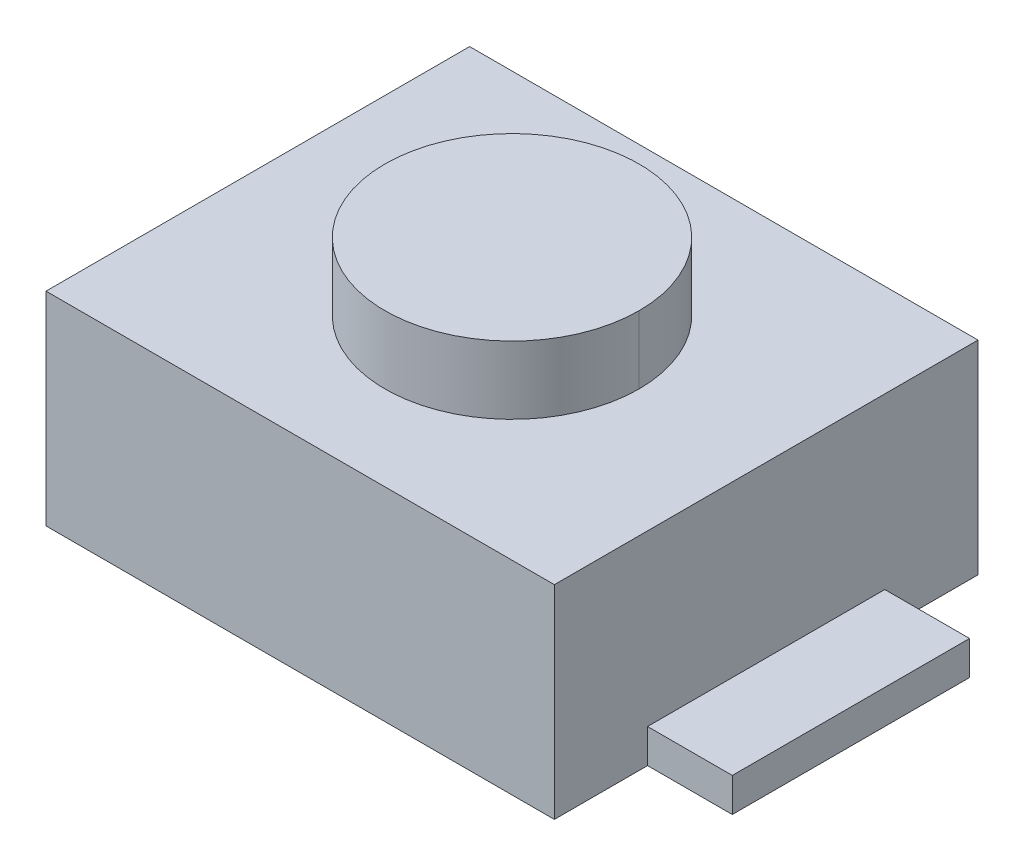
ISO-10303-21;
HEADER;
FILE_DESCRIPTION(('STEP AP214'),'2;1');
FILE_NAME('part.step','',(''),(''),'','','');
FILE_SCHEMA(('AUTOMOTIVE_DESIGN { 1 0 10303 214 1 1 1 1 }'));
ENDSEC;
DATA;
#1=APPLICATION_CONTEXT('core data for automotive mechanical design processes');
#2=APPLICATION_PROTOCOL_DEFINITION('international standard','automotive_design',2000,#1);
#3=PRODUCT_CONTEXT('',#1,'mechanical');
#4=PRODUCT('Part','Part','',(#3));
#5=PRODUCT_RELATED_PRODUCT_CATEGORY('part','',(#4));
#6=PRODUCT_DEFINITION_FORMATION('','',#4);
#7=PRODUCT_DEFINITION_CONTEXT('part definition',#1,'design');
#8=PRODUCT_DEFINITION('design','',#6,#7);
#9=PRODUCT_DEFINITION_SHAPE('','',#8);
#10=(LENGTH_UNIT() NAMED_UNIT(*) SI_UNIT(.MILLI.,.METRE.));
#11=(NAMED_UNIT(*) PLANE_ANGLE_UNIT() SI_UNIT($,.RADIAN.));
#12=(NAMED_UNIT(*) SI_UNIT($,.STERADIAN.) SOLID_ANGLE_UNIT());
#13=UNCERTAINTY_MEASURE_WITH_UNIT(LENGTH_MEASURE(1.E-05),#10,'distance_accuracy_value','');
#14=(GEOMETRIC_REPRESENTATION_CONTEXT(3) GLOBAL_UNCERTAINTY_ASSIGNED_CONTEXT((#13)) GLOBAL_UNIT_ASSIGNED_CONTEXT((#10,
#11,#12)) REPRESENTATION_CONTEXT('',''));
#15=CARTESIAN_POINT('',(0.,0.,0.));
#16=DIRECTION('',(0.,0.,1.));
#17=DIRECTION('',(1.,0.,0.));
#18=AXIS2_PLACEMENT_3D('',#15,#16,#17);
#19=CARTESIAN_POINT('',(0.,1.3,0.));
#20=DIRECTION('',(0.,-1.,0.));
#21=DIRECTION('',(0.,0.,1.));
#22=AXIS2_PLACEMENT_3D('',#19,#20,#21);
#23=CYLINDRICAL_SURFACE('',#22,0.75);
#24=DIRECTION('',(0.,1.,0.));
#25=VECTOR('',#24,1.);
#26=CARTESIAN_POINT('',(0.75,1.3,0.));
#27=LINE('',#26,#25);
#28=CARTESIAN_POINT('',(0.75,1.2,0.));
#29=VERTEX_POINT('',#28);
#30=CARTESIAN_POINT('',(0.75,1.6,0.));
#31=VERTEX_POINT('',#30);
#32=EDGE_CURVE('E11',#29,#31,#27,.T.);
#33=ORIENTED_EDGE('',*,*,#32,.F.);
#34=CARTESIAN_POINT('',(0.,1.2,0.));
#35=DIRECTION('',(0.,-1.,0.));
#36=DIRECTION('',(1.,0.,0.));
#37=AXIS2_PLACEMENT_3D('',#34,#35,#36);
#38=CIRCLE('',#37,0.75);
#39=CARTESIAN_POINT('',(-0.75,1.2,0.));
#40=VERTEX_POINT('',#39);
#41=EDGE_CURVE('E25',#40,#29,#38,.T.);
#42=ORIENTED_EDGE('',*,*,#41,.F.);
#43=DIRECTION('',(0.,-1.,0.));
#44=VECTOR('',#43,1.);
#45=CARTESIAN_POINT('',(-0.75,1.3,0.));
#46=LINE('',#45,#44);
#47=CARTESIAN_POINT('',(-0.75,1.6,0.));
#48=VERTEX_POINT('',#47);
#49=EDGE_CURVE('E303',#48,#40,#46,.T.);
#50=ORIENTED_EDGE('',*,*,#49,.F.);
#51=CARTESIAN_POINT('',(0.,1.6,0.));
#52=DIRECTION('',(0.,1.,0.));
#53=DIRECTION('',(1.,0.,0.));
#54=AXIS2_PLACEMENT_3D('',#51,#52,#53);
#55=CIRCLE('',#54,0.75);
#56=EDGE_CURVE('E298',#31,#48,#55,.T.);
#57=ORIENTED_EDGE('',*,*,#56,.F.);
#58=EDGE_LOOP('',(#33,#42,#50,#57));
#59=FACE_BOUND('',#58,.T.);
#60=ADVANCED_FACE('F17',(#59),#23,.T.);
#61=CARTESIAN_POINT('',(0.,1.6,0.));
#62=DIRECTION('',(0.,1.,0.));
#63=DIRECTION('',(1.,0.,0.));
#64=AXIS2_PLACEMENT_3D('',#61,#62,#63);
#65=PLANE('',#64);
#66=ORIENTED_EDGE('',*,*,#56,.T.);
#67=CARTESIAN_POINT('',(0.,1.6,0.));
#68=DIRECTION('',(0.,1.,0.));
#69=DIRECTION('',(1.,0.,0.));
#70=AXIS2_PLACEMENT_3D('',#67,#68,#69);
#71=CIRCLE('',#70,0.75);
#72=EDGE_CURVE('E293',#48,#31,#71,.T.);
#73=ORIENTED_EDGE('',*,*,#72,.T.);
#74=EDGE_LOOP('',(#66,#73));
#75=FACE_BOUND('',#74,.T.);
#76=ADVANCED_FACE('F317',(#75),#65,.T.);
#77=CARTESIAN_POINT('',(0.,1.3,0.));
#78=DIRECTION('',(0.,-1.,0.));
#79=DIRECTION('',(0.,0.,-1.));
#80=AXIS2_PLACEMENT_3D('',#77,#78,#79);
#81=CYLINDRICAL_SURFACE('',#80,0.75);
#82=ORIENTED_EDGE('',*,*,#32,.T.);
#83=ORIENTED_EDGE('',*,*,#72,.F.);
#84=ORIENTED_EDGE('',*,*,#49,.T.);
#85=CARTESIAN_POINT('',(0.,1.2,0.));
#86=DIRECTION('',(0.,-1.,0.));
#87=DIRECTION('',(1.,0.,0.));
#88=AXIS2_PLACEMENT_3D('',#85,#86,#87);
#89=CIRCLE('',#88,0.75);
#90=EDGE_CURVE('E288',#29,#40,#89,.T.);
#91=ORIENTED_EDGE('',*,*,#90,.F.);
#92=EDGE_LOOP('',(#82,#83,#84,#91));
#93=FACE_BOUND('',#92,.T.);
#94=ADVANCED_FACE('F314',(#93),#81,.T.);
#95=CARTESIAN_POINT('',(0.,1.2,0.));
#96=DIRECTION('',(0.,-1.,0.));
#97=DIRECTION('',(0.,0.,-1.));
#98=AXIS2_PLACEMENT_3D('',#95,#96,#97);
#99=PLANE('',#98);
#100=DIRECTION('',(0.,0.,-1.));
#101=VECTOR('',#100,1.);
#102=CARTESIAN_POINT('',(1.5,1.2,0.));
#103=LINE('',#102,#101);
#104=CARTESIAN_POINT('',(1.5,1.2,1.25));
#105=VERTEX_POINT('',#104);
#106=CARTESIAN_POINT('',(1.5,1.2,-1.25));
#107=VERTEX_POINT('',#106);
#108=EDGE_CURVE('E284',#105,#107,#103,.T.);
#109=ORIENTED_EDGE('',*,*,#108,.T.);
#110=DIRECTION('',(1.,0.,0.));
#111=VECTOR('',#110,1.);
#112=CARTESIAN_POINT('',(0.,1.2,-1.25));
#113=LINE('',#112,#111);
#114=CARTESIAN_POINT('',(-1.5,1.2,-1.25));
#115=VERTEX_POINT('',#114);
#116=EDGE_CURVE('E279',#115,#107,#113,.T.);
#117=ORIENTED_EDGE('',*,*,#116,.F.);
#118=DIRECTION('',(0.,0.,-1.));
#119=VECTOR('',#118,1.);
#120=CARTESIAN_POINT('',(-1.5,1.2,0.));
#121=LINE('',#120,#119);
#122=CARTESIAN_POINT('',(-1.5,1.2,1.25));
#123=VERTEX_POINT('',#122);
#124=EDGE_CURVE('E274',#123,#115,#121,.T.);
#125=ORIENTED_EDGE('',*,*,#124,.F.);
#126=DIRECTION('',(-1.,0.,0.));
#127=VECTOR('',#126,1.);
#128=CARTESIAN_POINT('',(0.,1.2,1.25));
#129=LINE('',#128,#127);
#130=EDGE_CURVE('E269',#105,#123,#129,.T.);
#131=ORIENTED_EDGE('',*,*,#130,.F.);
#132=EDGE_LOOP('',(#109,#117,#125,#131));
#133=FACE_BOUND('',#132,.T.);
#134=ORIENTED_EDGE('',*,*,#41,.T.);
#135=ORIENTED_EDGE('',*,*,#90,.T.);
#136=EDGE_LOOP('',(#134,#135));
#137=FACE_BOUND('',#136,.T.);
#138=ADVANCED_FACE('F312',(#133,#137),#99,.F.);
#139=CARTESIAN_POINT('',(0.,0.6,1.25));
#140=DIRECTION('',(0.,0.,1.));
#141=DIRECTION('',(1.,0.,0.));
#142=AXIS2_PLACEMENT_3D('',#139,#140,#141);
#143=PLANE('',#142);
#144=DIRECTION('',(0.,1.,0.));
#145=VECTOR('',#144,1.);
#146=CARTESIAN_POINT('',(1.5,0.6,1.25));
#147=LINE('',#146,#145);
#148=CARTESIAN_POINT('',(1.5,0.,1.25));
#149=VERTEX_POINT('',#148);
#150=EDGE_CURVE('E264',#149,#105,#147,.T.);
#151=ORIENTED_EDGE('',*,*,#150,.T.);
#152=ORIENTED_EDGE('',*,*,#130,.T.);
#153=DIRECTION('',(0.,-1.,0.));
#154=VECTOR('',#153,1.);
#155=CARTESIAN_POINT('',(-1.5,0.6,1.25));
#156=LINE('',#155,#154);
#157=CARTESIAN_POINT('',(-1.5,0.,1.25));
#158=VERTEX_POINT('',#157);
#159=EDGE_CURVE('E260',#123,#158,#156,.T.);
#160=ORIENTED_EDGE('',*,*,#159,.T.);
#161=DIRECTION('',(1.,0.,0.));
#162=VECTOR('',#161,1.);
#163=CARTESIAN_POINT('',(0.,0.,1.25));
#164=LINE('',#163,#162);
#165=EDGE_CURVE('E256',#158,#149,#164,.T.);
#166=ORIENTED_EDGE('',*,*,#165,.T.);
#167=EDGE_LOOP('',(#151,#152,#160,#166));
#168=FACE_BOUND('',#167,.T.);
#169=ADVANCED_FACE('F328',(#168),#143,.T.);
#170=CARTESIAN_POINT('',(0.,0.,0.));
#171=DIRECTION('',(0.,1.,0.));
#172=DIRECTION('',(1.,0.,0.));
#173=AXIS2_PLACEMENT_3D('',#170,#171,#172);
#174=PLANE('',#173);
#175=DIRECTION('',(0.,0.,-1.));
#176=VECTOR('',#175,1.);
#177=CARTESIAN_POINT('',(1.5,0.,0.));
#178=LINE('',#177,#176);
#179=CARTESIAN_POINT('',(1.5,0.,0.7));
#180=VERTEX_POINT('',#179);
#181=EDGE_CURVE('E251',#149,#180,#178,.T.);
#182=ORIENTED_EDGE('',*,*,#181,.F.);
#183=ORIENTED_EDGE('',*,*,#165,.F.);
#184=DIRECTION('',(0.,0.,-1.));
#185=VECTOR('',#184,1.);
#186=CARTESIAN_POINT('',(-1.5,0.,0.));
#187=LINE('',#186,#185);
#188=CARTESIAN_POINT('',(-1.5,0.,0.7));
#189=VERTEX_POINT('',#188);
#190=EDGE_CURVE('E247',#158,#189,#187,.T.);
#191=ORIENTED_EDGE('',*,*,#190,.T.);
#192=DIRECTION('',(1.,0.,0.));
#193=VECTOR('',#192,1.);
#194=CARTESIAN_POINT('',(0.,0.,0.7));
#195=LINE('',#194,#193);
#196=CARTESIAN_POINT('',(-2.,0.,0.7));
#197=VERTEX_POINT('',#196);
#198=EDGE_CURVE('E243',#197,#189,#195,.T.);
#199=ORIENTED_EDGE('',*,*,#198,.F.);
#200=DIRECTION('',(0.,0.,-1.));
#201=VECTOR('',#200,1.);
#202=CARTESIAN_POINT('',(-2.,0.,0.));
#203=LINE('',#202,#201);
#204=CARTESIAN_POINT('',(-2.,0.,-0.7));
#205=VERTEX_POINT('',#204);
#206=EDGE_CURVE('E131',#197,#205,#203,.T.);
#207=ORIENTED_EDGE('',*,*,#206,.T.);
#208=DIRECTION('',(-1.,0.,0.));
#209=VECTOR('',#208,1.);
#210=CARTESIAN_POINT('',(0.,0.,-0.7));
#211=LINE('',#210,#209);
#212=CARTESIAN_POINT('',(-1.5,0.,-0.7));
#213=VERTEX_POINT('',#212);
#214=EDGE_CURVE('E235',#213,#205,#211,.T.);
#215=ORIENTED_EDGE('',*,*,#214,.F.);
#216=DIRECTION('',(0.,0.,-1.));
#217=VECTOR('',#216,1.);
#218=CARTESIAN_POINT('',(-1.5,0.,0.));
#219=LINE('',#218,#217);
#220=CARTESIAN_POINT('',(-1.5,0.,-1.25));
#221=VERTEX_POINT('',#220);
#222=EDGE_CURVE('E231',#213,#221,#219,.T.);
#223=ORIENTED_EDGE('',*,*,#222,.T.);
#224=DIRECTION('',(-1.,0.,0.));
#225=VECTOR('',#224,1.);
#226=CARTESIAN_POINT('',(0.,0.,-1.25));
#227=LINE('',#226,#225);
#228=CARTESIAN_POINT('',(1.5,0.,-1.25));
#229=VERTEX_POINT('',#228);
#230=EDGE_CURVE('E226',#229,#221,#227,.T.);
#231=ORIENTED_EDGE('',*,*,#230,.F.);
#232=DIRECTION('',(0.,0.,-1.));
#233=VECTOR('',#232,1.);
#234=CARTESIAN_POINT('',(1.5,0.,0.));
#235=LINE('',#234,#233);
#236=CARTESIAN_POINT('',(1.5,0.,-0.7));
#237=VERTEX_POINT('',#236);
#238=EDGE_CURVE('E221',#237,#229,#235,.T.);
#239=ORIENTED_EDGE('',*,*,#238,.F.);
#240=DIRECTION('',(-1.,0.,0.));
#241=VECTOR('',#240,1.);
#242=CARTESIAN_POINT('',(0.,0.,-0.7));
#243=LINE('',#242,#241);
#244=CARTESIAN_POINT('',(2.,0.,-0.7));
#245=VERTEX_POINT('',#244);
#246=EDGE_CURVE('E216',#245,#237,#243,.T.);
#247=ORIENTED_EDGE('',*,*,#246,.F.);
#248=DIRECTION('',(0.,0.,-1.));
#249=VECTOR('',#248,1.);
#250=CARTESIAN_POINT('',(2.,0.,0.));
#251=LINE('',#250,#249);
#252=CARTESIAN_POINT('',(2.,0.,0.7));
#253=VERTEX_POINT('',#252);
#254=EDGE_CURVE('E211',#253,#245,#251,.T.);
#255=ORIENTED_EDGE('',*,*,#254,.F.);
#256=DIRECTION('',(1.,0.,0.));
#257=VECTOR('',#256,1.);
#258=CARTESIAN_POINT('',(0.,0.,0.7));
#259=LINE('',#258,#257);
#260=EDGE_CURVE('E206',#180,#253,#259,.T.);
#261=ORIENTED_EDGE('',*,*,#260,.F.);
#262=EDGE_LOOP('',(#182,#183,#191,#199,#207,#215,#223,#231,#239,#247,#255,#261));
#263=FACE_BOUND('',#262,.T.);
#264=ADVANCED_FACE('F332',(#263),#174,.F.);
#265=CARTESIAN_POINT('',(0.,0.1,0.7));
#266=DIRECTION('',(0.,0.,1.));
#267=DIRECTION('',(1.,0.,0.));
#268=AXIS2_PLACEMENT_3D('',#265,#266,#267);
#269=PLANE('',#268);
#270=DIRECTION('',(0.,1.,0.));
#271=VECTOR('',#270,1.);
#272=CARTESIAN_POINT('',(1.5,0.35,0.7));
#273=LINE('',#272,#271);
#274=CARTESIAN_POINT('',(1.5,0.2,0.7));
#275=VERTEX_POINT('',#274);
#276=EDGE_CURVE('E201',#180,#275,#273,.T.);
#277=ORIENTED_EDGE('',*,*,#276,.F.);
#278=ORIENTED_EDGE('',*,*,#260,.T.);
#279=DIRECTION('',(0.,1.,0.));
#280=VECTOR('',#279,1.);
#281=CARTESIAN_POINT('',(2.,0.1,0.7));
#282=LINE('',#281,#280);
#283=CARTESIAN_POINT('',(2.,0.2,0.7));
#284=VERTEX_POINT('',#283);
#285=EDGE_CURVE('E197',#253,#284,#282,.T.);
#286=ORIENTED_EDGE('',*,*,#285,.T.);
#287=DIRECTION('',(-1.,0.,0.));
#288=VECTOR('',#287,1.);
#289=CARTESIAN_POINT('',(0.,0.2,0.7));
#290=LINE('',#289,#288);
#291=EDGE_CURVE('E193',#284,#275,#290,.T.);
#292=ORIENTED_EDGE('',*,*,#291,.T.);
#293=EDGE_LOOP('',(#277,#278,#286,#292));
#294=FACE_BOUND('',#293,.T.);
#295=ADVANCED_FACE('F336',(#294),#269,.T.);
#296=CARTESIAN_POINT('',(0.,0.2,0.));
#297=DIRECTION('',(0.,-1.,0.));
#298=DIRECTION('',(0.,0.,-1.));
#299=AXIS2_PLACEMENT_3D('',#296,#297,#298);
#300=PLANE('',#299);
#301=DIRECTION('',(0.,0.,-1.));
#302=VECTOR('',#301,1.);
#303=CARTESIAN_POINT('',(1.5,0.2,0.));
#304=LINE('',#303,#302);
#305=CARTESIAN_POINT('',(1.5,0.2,-0.7));
#306=VERTEX_POINT('',#305);
#307=EDGE_CURVE('E188',#275,#306,#304,.T.);
#308=ORIENTED_EDGE('',*,*,#307,.F.);
#309=ORIENTED_EDGE('',*,*,#291,.F.);
#310=DIRECTION('',(0.,0.,-1.));
#311=VECTOR('',#310,1.);
#312=CARTESIAN_POINT('',(2.,0.2,0.));
#313=LINE('',#312,#311);
#314=CARTESIAN_POINT('',(2.,0.2,-0.7));
#315=VERTEX_POINT('',#314);
#316=EDGE_CURVE('E184',#284,#315,#313,.T.);
#317=ORIENTED_EDGE('',*,*,#316,.T.);
#318=DIRECTION('',(1.,0.,0.));
#319=VECTOR('',#318,1.);
#320=CARTESIAN_POINT('',(0.,0.2,-0.7));
#321=LINE('',#320,#319);
#322=EDGE_CURVE('E179',#306,#315,#321,.T.);
#323=ORIENTED_EDGE('',*,*,#322,.F.);
#324=EDGE_LOOP('',(#308,#309,#317,#323));
#325=FACE_BOUND('',#324,.T.);
#326=ADVANCED_FACE('F340',(#325),#300,.F.);
#327=CARTESIAN_POINT('',(0.,0.1,-0.7));
#328=DIRECTION('',(0.,0.,1.));
#329=DIRECTION('',(1.,0.,0.));
#330=AXIS2_PLACEMENT_3D('',#327,#328,#329);
#331=PLANE('',#330);
#332=DIRECTION('',(0.,-1.,0.));
#333=VECTOR('',#332,1.);
#334=CARTESIAN_POINT('',(1.5,0.35,-0.7));
#335=LINE('',#334,#333);
#336=EDGE_CURVE('E174',#306,#237,#335,.T.);
#337=ORIENTED_EDGE('',*,*,#336,.F.);
#338=ORIENTED_EDGE('',*,*,#322,.T.);
#339=DIRECTION('',(0.,-1.,0.));
#340=VECTOR('',#339,1.);
#341=CARTESIAN_POINT('',(2.,0.1,-0.7));
#342=LINE('',#341,#340);
#343=EDGE_CURVE('E169',#315,#245,#342,.T.);
#344=ORIENTED_EDGE('',*,*,#343,.T.);
#345=ORIENTED_EDGE('',*,*,#246,.T.);
#346=EDGE_LOOP('',(#337,#338,#344,#345));
#347=FACE_BOUND('',#346,.T.);
#348=ADVANCED_FACE('F344',(#347),#331,.F.);
#349=CARTESIAN_POINT('',(2.,0.1,0.));
#350=DIRECTION('',(-1.,0.,0.));
#351=DIRECTION('',(0.,0.,1.));
#352=AXIS2_PLACEMENT_3D('',#349,#350,#351);
#353=PLANE('',#352);
#354=ORIENTED_EDGE('',*,*,#254,.T.);
#355=ORIENTED_EDGE('',*,*,#343,.F.);
#356=ORIENTED_EDGE('',*,*,#316,.F.);
#357=ORIENTED_EDGE('',*,*,#285,.F.);
#358=EDGE_LOOP('',(#354,#355,#356,#357));
#359=FACE_BOUND('',#358,.T.);
#360=ADVANCED_FACE('F348',(#359),#353,.F.);
#361=CARTESIAN_POINT('',(1.5,0.6,0.));
#362=DIRECTION('',(-1.,0.,0.));
#363=DIRECTION('',(0.,0.,1.));
#364=AXIS2_PLACEMENT_3D('',#361,#362,#363);
#365=PLANE('',#364);
#366=ORIENTED_EDGE('',*,*,#276,.T.);
#367=ORIENTED_EDGE('',*,*,#307,.T.);
#368=ORIENTED_EDGE('',*,*,#336,.T.);
#369=ORIENTED_EDGE('',*,*,#238,.T.);
#370=DIRECTION('',(0.,-1.,0.));
#371=VECTOR('',#370,1.);
#372=CARTESIAN_POINT('',(1.5,0.6,-1.25));
#373=LINE('',#372,#371);
#374=EDGE_CURVE('E164',#107,#229,#373,.T.);
#375=ORIENTED_EDGE('',*,*,#374,.F.);
#376=ORIENTED_EDGE('',*,*,#108,.F.);
#377=ORIENTED_EDGE('',*,*,#150,.F.);
#378=ORIENTED_EDGE('',*,*,#181,.T.);
#379=EDGE_LOOP('',(#366,#367,#368,#369,#375,#376,#377,#378));
#380=FACE_BOUND('',#379,.T.);
#381=ADVANCED_FACE('F352',(#380),#365,.F.);
#382=CARTESIAN_POINT('',(0.,0.6,-1.25));
#383=DIRECTION('',(0.,0.,1.));
#384=DIRECTION('',(1.,0.,0.));
#385=AXIS2_PLACEMENT_3D('',#382,#383,#384);
#386=PLANE('',#385);
#387=ORIENTED_EDGE('',*,*,#374,.T.);
#388=ORIENTED_EDGE('',*,*,#230,.T.);
#389=DIRECTION('',(0.,1.,0.));
#390=VECTOR('',#389,1.);
#391=CARTESIAN_POINT('',(-1.5,0.6,-1.25));
#392=LINE('',#391,#390);
#393=EDGE_CURVE('E159',#221,#115,#392,.T.);
#394=ORIENTED_EDGE('',*,*,#393,.T.);
#395=ORIENTED_EDGE('',*,*,#116,.T.);
#396=EDGE_LOOP('',(#387,#388,#394,#395));
#397=FACE_BOUND('',#396,.T.);
#398=ADVANCED_FACE('F356',(#397),#386,.F.);
#399=CARTESIAN_POINT('',(-1.5,0.6,0.));
#400=DIRECTION('',(1.,0.,0.));
#401=DIRECTION('',(0.,1.,0.));
#402=AXIS2_PLACEMENT_3D('',#399,#400,#401);
#403=PLANE('',#402);
#404=DIRECTION('',(0.,-1.,0.));
#405=VECTOR('',#404,1.);
#406=CARTESIAN_POINT('',(-1.5,0.35,0.7));
#407=LINE('',#406,#405);
#408=CARTESIAN_POINT('',(-1.5,0.2,0.7));
#409=VERTEX_POINT('',#408);
#410=EDGE_CURVE('E138',#409,#189,#407,.T.);
#411=ORIENTED_EDGE('',*,*,#410,.T.);
#412=ORIENTED_EDGE('',*,*,#190,.F.);
#413=ORIENTED_EDGE('',*,*,#159,.F.);
#414=ORIENTED_EDGE('',*,*,#124,.T.);
#415=ORIENTED_EDGE('',*,*,#393,.F.);
#416=ORIENTED_EDGE('',*,*,#222,.F.);
#417=DIRECTION('',(0.,1.,0.));
#418=VECTOR('',#417,1.);
#419=CARTESIAN_POINT('',(-1.5,0.35,-0.7));
#420=LINE('',#419,#418);
#421=CARTESIAN_POINT('',(-1.5,0.2,-0.7));
#422=VERTEX_POINT('',#421);
#423=EDGE_CURVE('E152',#213,#422,#420,.T.);
#424=ORIENTED_EDGE('',*,*,#423,.T.);
#425=DIRECTION('',(0.,0.,1.));
#426=VECTOR('',#425,1.);
#427=CARTESIAN_POINT('',(-1.5,0.2,0.));
#428=LINE('',#427,#426);
#429=EDGE_CURVE('E148',#422,#409,#428,.T.);
#430=ORIENTED_EDGE('',*,*,#429,.T.);
#431=EDGE_LOOP('',(#411,#412,#413,#414,#415,#416,#424,#430));
#432=FACE_BOUND('',#431,.T.);
#433=ADVANCED_FACE('F360',(#432),#403,.F.);
#434=CARTESIAN_POINT('',(0.,0.2,0.));
#435=DIRECTION('',(0.,-1.,0.));
#436=DIRECTION('',(0.,0.,-1.));
#437=AXIS2_PLACEMENT_3D('',#434,#435,#436);
#438=PLANE('',#437);
#439=ORIENTED_EDGE('',*,*,#429,.F.);
#440=DIRECTION('',(1.,0.,0.));
#441=VECTOR('',#440,1.);
#442=CARTESIAN_POINT('',(0.,0.2,-0.7));
#443=LINE('',#442,#441);
#444=CARTESIAN_POINT('',(-2.,0.2,-0.7));
#445=VERTEX_POINT('',#444);
#446=EDGE_CURVE('E122',#445,#422,#443,.T.);
#447=ORIENTED_EDGE('',*,*,#446,.F.);
#448=DIRECTION('',(0.,0.,-1.));
#449=VECTOR('',#448,1.);
#450=CARTESIAN_POINT('',(-2.,0.2,0.));
#451=LINE('',#450,#449);
#452=CARTESIAN_POINT('',(-2.,0.2,0.7));
#453=VERTEX_POINT('',#452);
#454=EDGE_CURVE('E114',#453,#445,#451,.T.);
#455=ORIENTED_EDGE('',*,*,#454,.F.);
#456=DIRECTION('',(-1.,0.,0.));
#457=VECTOR('',#456,1.);
#458=CARTESIAN_POINT('',(0.,0.2,0.7));
#459=LINE('',#458,#457);
#460=EDGE_CURVE('E119',#409,#453,#459,.T.);
#461=ORIENTED_EDGE('',*,*,#460,.F.);
#462=EDGE_LOOP('',(#439,#447,#455,#461));
#463=FACE_BOUND('',#462,.T.);
#464=ADVANCED_FACE('F117',(#463),#438,.F.);
#465=CARTESIAN_POINT('',(0.,0.1,0.7));
#466=DIRECTION('',(0.,0.,1.));
#467=DIRECTION('',(1.,0.,0.));
#468=AXIS2_PLACEMENT_3D('',#465,#466,#467);
#469=PLANE('',#468);
#470=ORIENTED_EDGE('',*,*,#410,.F.);
#471=ORIENTED_EDGE('',*,*,#460,.T.);
#472=DIRECTION('',(0.,-1.,0.));
#473=VECTOR('',#472,1.);
#474=CARTESIAN_POINT('',(-2.,0.1,0.7));
#475=LINE('',#474,#473);
#476=EDGE_CURVE('E129',#453,#197,#475,.T.);
#477=ORIENTED_EDGE('',*,*,#476,.T.);
#478=ORIENTED_EDGE('',*,*,#198,.T.);
#479=EDGE_LOOP('',(#470,#471,#477,#478));
#480=FACE_BOUND('',#479,.T.);
#481=ADVANCED_FACE('F136',(#480),#469,.T.);
#482=CARTESIAN_POINT('',(-2.,0.1,0.));
#483=DIRECTION('',(1.,0.,0.));
#484=DIRECTION('',(0.,1.,0.));
#485=AXIS2_PLACEMENT_3D('',#482,#483,#484);
#486=PLANE('',#485);
#487=ORIENTED_EDGE('',*,*,#454,.T.);
#488=DIRECTION('',(0.,1.,0.));
#489=VECTOR('',#488,1.);
#490=CARTESIAN_POINT('',(-2.,0.1,-0.7));
#491=LINE('',#490,#489);
#492=EDGE_CURVE('E134',#205,#445,#491,.T.);
#493=ORIENTED_EDGE('',*,*,#492,.F.);
#494=ORIENTED_EDGE('',*,*,#206,.F.);
#495=ORIENTED_EDGE('',*,*,#476,.F.);
#496=EDGE_LOOP('',(#487,#493,#494,#495));
#497=FACE_BOUND('',#496,.T.);
#498=ADVANCED_FACE('F130',(#497),#486,.F.);
#499=CARTESIAN_POINT('',(0.,0.1,-0.7));
#500=DIRECTION('',(0.,0.,1.));
#501=DIRECTION('',(1.,0.,0.));
#502=AXIS2_PLACEMENT_3D('',#499,#500,#501);
#503=PLANE('',#502);
#504=ORIENTED_EDGE('',*,*,#423,.F.);
#505=ORIENTED_EDGE('',*,*,#214,.T.);
#506=ORIENTED_EDGE('',*,*,#492,.T.);
#507=ORIENTED_EDGE('',*,*,#446,.T.);
#508=EDGE_LOOP('',(#504,#505,#506,#507));
#509=FACE_BOUND('',#508,.T.);
#510=ADVANCED_FACE('F371',(#509),#503,.F.);
#511=CLOSED_SHELL('',(#60,#76,#94,#138,#169,#264,#295,#326,#348,#360,#381,#398,#433,#464,#481,
#498,#510));
#512=MANIFOLD_SOLID_BREP('B1',#511);
#513=ADVANCED_BREP_SHAPE_REPRESENTATION('',(#18,#512),#14);
#514=SHAPE_DEFINITION_REPRESENTATION(#9,#513);
ENDSEC;
END-ISO-10303-21;
